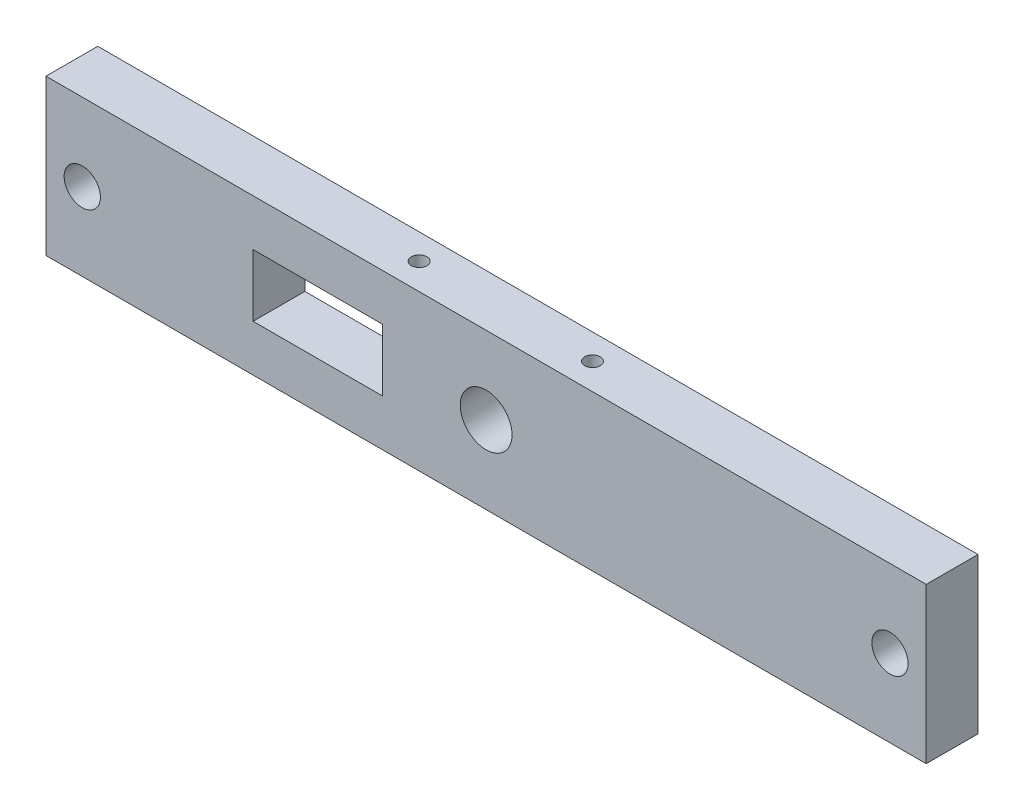
ISO-10303-21;
HEADER;
FILE_DESCRIPTION(('STEP AP214'),'2;1');
FILE_NAME('part.step','',(''),(''),'','','');
FILE_SCHEMA(('AUTOMOTIVE_DESIGN { 1 0 10303 214 1 1 1 1 }'));
ENDSEC;
DATA;
#1=APPLICATION_CONTEXT('core data for automotive mechanical design processes');
#2=APPLICATION_PROTOCOL_DEFINITION('international standard','automotive_design',2000,#1);
#3=PRODUCT_CONTEXT('',#1,'mechanical');
#4=PRODUCT('Part','Part','',(#3));
#5=PRODUCT_RELATED_PRODUCT_CATEGORY('part','',(#4));
#6=PRODUCT_DEFINITION_FORMATION('','',#4);
#7=PRODUCT_DEFINITION_CONTEXT('part definition',#1,'design');
#8=PRODUCT_DEFINITION('design','',#6,#7);
#9=PRODUCT_DEFINITION_SHAPE('','',#8);
#10=(LENGTH_UNIT() NAMED_UNIT(*) SI_UNIT(.MILLI.,.METRE.));
#11=(NAMED_UNIT(*) PLANE_ANGLE_UNIT() SI_UNIT($,.RADIAN.));
#12=(NAMED_UNIT(*) SI_UNIT($,.STERADIAN.) SOLID_ANGLE_UNIT());
#13=UNCERTAINTY_MEASURE_WITH_UNIT(LENGTH_MEASURE(1.E-05),#10,'distance_accuracy_value','');
#14=(GEOMETRIC_REPRESENTATION_CONTEXT(3) GLOBAL_UNCERTAINTY_ASSIGNED_CONTEXT((#13)) GLOBAL_UNIT_ASSIGNED_CONTEXT((#10,
#11,#12)) REPRESENTATION_CONTEXT('',''));
#15=CARTESIAN_POINT('',(0.,0.,0.));
#16=DIRECTION('',(0.,0.,1.));
#17=DIRECTION('',(1.,0.,0.));
#18=AXIS2_PLACEMENT_3D('',#15,#16,#17);
#19=CARTESIAN_POINT('',(-277.217741935484,26.4516129032258,10.));
#20=DIRECTION('',(0.,1.,0.));
#21=DIRECTION('',(0.,0.,1.));
#22=AXIS2_PLACEMENT_3D('',#19,#20,#21);
#23=PLANE('',#22);
#24=CARTESIAN_POINT('',(-210.232722869532,26.4516129032258,4.91811372302718));
#25=DIRECTION('',(0.,1.,0.));
#26=DIRECTION('',(0.,0.,1.));
#27=AXIS2_PLACEMENT_3D('',#24,#25,#26);
#28=CIRCLE('',#27,1.5);
#29=CARTESIAN_POINT('',(-210.232722869532,26.4516129032258,6.41811372302718));
#30=VERTEX_POINT('',#29);
#31=EDGE_CURVE('E131',#30,#30,#28,.F.);
#32=ORIENTED_EDGE('',*,*,#31,.F.);
#33=EDGE_LOOP('',(#32));
#34=FACE_BOUND('',#33,.T.);
#35=DIRECTION('',(1.,0.,0.));
#36=VECTOR('',#35,1.);
#37=CARTESIAN_POINT('',(-277.217741935484,26.4516129032258,0.));
#38=LINE('',#37,#36);
#39=CARTESIAN_POINT('',(-277.217741935484,26.4516129032258,0.));
#40=VERTEX_POINT('',#39);
#41=CARTESIAN_POINT('',(-107.217741935484,26.4516129032258,0.));
#42=VERTEX_POINT('',#41);
#43=EDGE_CURVE('E172',#40,#42,#38,.T.);
#44=ORIENTED_EDGE('',*,*,#43,.T.);
#45=DIRECTION('',(0.,0.,-1.));
#46=VECTOR('',#45,1.);
#47=CARTESIAN_POINT('',(-107.217741935484,26.4516129032258,10.));
#48=LINE('',#47,#46);
#49=CARTESIAN_POINT('',(-107.217741935484,26.4516129032258,10.));
#50=VERTEX_POINT('',#49);
#51=EDGE_CURVE('E44',#50,#42,#48,.T.);
#52=ORIENTED_EDGE('',*,*,#51,.F.);
#53=DIRECTION('',(1.,0.,0.));
#54=VECTOR('',#53,1.);
#55=CARTESIAN_POINT('',(-277.217741935484,26.4516129032258,10.));
#56=LINE('',#55,#54);
#57=CARTESIAN_POINT('',(-277.217741935484,26.4516129032258,10.));
#58=VERTEX_POINT('',#57);
#59=EDGE_CURVE('E162',#58,#50,#56,.T.);
#60=ORIENTED_EDGE('',*,*,#59,.F.);
#61=DIRECTION('',(0.,0.,-1.));
#62=VECTOR('',#61,1.);
#63=CARTESIAN_POINT('',(-277.217741935484,26.4516129032258,10.));
#64=LINE('',#63,#62);
#65=EDGE_CURVE('E12',#58,#40,#64,.T.);
#66=ORIENTED_EDGE('',*,*,#65,.T.);
#67=EDGE_LOOP('',(#44,#52,#60,#66));
#68=FACE_BOUND('',#67,.T.);
#69=CARTESIAN_POINT('',(-176.768107744617,26.4516129032258,4.91221798755203));
#70=DIRECTION('',(0.,1.,0.));
#71=DIRECTION('',(0.,0.,1.));
#72=AXIS2_PLACEMENT_3D('',#69,#70,#71);
#73=CIRCLE('',#72,1.5);
#74=CARTESIAN_POINT('',(-176.768107744617,26.4516129032258,6.41221798755203));
#75=VERTEX_POINT('',#74);
#76=EDGE_CURVE('E185',#75,#75,#73,.F.);
#77=ORIENTED_EDGE('',*,*,#76,.F.);
#78=EDGE_LOOP('',(#77));
#79=FACE_BOUND('',#78,.T.);
#80=ADVANCED_FACE('F35',(#34,#68,#79),#23,.F.);
#81=CARTESIAN_POINT('',(-277.217741935484,56.4516129032258,10.));
#82=DIRECTION('',(0.,-1.,0.));
#83=DIRECTION('',(0.,0.,-1.));
#84=AXIS2_PLACEMENT_3D('',#81,#82,#83);
#85=PLANE('',#84);
#86=CARTESIAN_POINT('',(-210.232722869532,56.4516129032258,4.91811372302718));
#87=DIRECTION('',(0.,-1.,0.));
#88=DIRECTION('',(0.,0.,-1.));
#89=AXIS2_PLACEMENT_3D('',#86,#87,#88);
#90=CIRCLE('',#89,1.5);
#91=CARTESIAN_POINT('',(-210.232722869532,56.4516129032258,3.41811372302718));
#92=VERTEX_POINT('',#91);
#93=EDGE_CURVE('E183',#92,#92,#90,.F.);
#94=ORIENTED_EDGE('',*,*,#93,.F.);
#95=EDGE_LOOP('',(#94));
#96=FACE_BOUND('',#95,.T.);
#97=DIRECTION('',(-1.,0.,0.));
#98=VECTOR('',#97,1.);
#99=CARTESIAN_POINT('',(-277.217741935484,56.4516129032258,0.));
#100=LINE('',#99,#98);
#101=CARTESIAN_POINT('',(-107.217741935484,56.4516129032258,0.));
#102=VERTEX_POINT('',#101);
#103=CARTESIAN_POINT('',(-277.217741935484,56.4516129032258,0.));
#104=VERTEX_POINT('',#103);
#105=EDGE_CURVE('E163',#102,#104,#100,.T.);
#106=ORIENTED_EDGE('',*,*,#105,.T.);
#107=DIRECTION('',(0.,0.,-1.));
#108=VECTOR('',#107,1.);
#109=CARTESIAN_POINT('',(-277.217741935484,56.4516129032258,10.));
#110=LINE('',#109,#108);
#111=CARTESIAN_POINT('',(-277.217741935484,56.4516129032258,10.));
#112=VERTEX_POINT('',#111);
#113=EDGE_CURVE('E169',#112,#104,#110,.T.);
#114=ORIENTED_EDGE('',*,*,#113,.F.);
#115=DIRECTION('',(-1.,0.,0.));
#116=VECTOR('',#115,1.);
#117=CARTESIAN_POINT('',(-277.217741935484,56.4516129032258,10.));
#118=LINE('',#117,#116);
#119=CARTESIAN_POINT('',(-107.217741935484,56.4516129032258,10.));
#120=VERTEX_POINT('',#119);
#121=EDGE_CURVE('E167',#120,#112,#118,.T.);
#122=ORIENTED_EDGE('',*,*,#121,.F.);
#123=DIRECTION('',(0.,0.,-1.));
#124=VECTOR('',#123,1.);
#125=CARTESIAN_POINT('',(-107.217741935484,56.4516129032258,10.));
#126=LINE('',#125,#124);
#127=EDGE_CURVE('E179',#120,#102,#126,.T.);
#128=ORIENTED_EDGE('',*,*,#127,.T.);
#129=EDGE_LOOP('',(#106,#114,#122,#128));
#130=FACE_BOUND('',#129,.T.);
#131=CARTESIAN_POINT('',(-176.768107744617,56.4516129032258,4.91221798755203));
#132=DIRECTION('',(0.,-1.,0.));
#133=DIRECTION('',(0.,0.,-1.));
#134=AXIS2_PLACEMENT_3D('',#131,#132,#133);
#135=CIRCLE('',#134,1.5);
#136=CARTESIAN_POINT('',(-176.768107744617,56.4516129032258,3.41221798755203));
#137=VERTEX_POINT('',#136);
#138=EDGE_CURVE('E39',#137,#137,#135,.F.);
#139=ORIENTED_EDGE('',*,*,#138,.F.);
#140=EDGE_LOOP('',(#139));
#141=FACE_BOUND('',#140,.T.);
#142=ADVANCED_FACE('F198',(#96,#130,#141),#85,.F.);
#143=CARTESIAN_POINT('',(0.,0.,10.));
#144=DIRECTION('',(0.,0.,1.));
#145=DIRECTION('',(1.,0.,0.));
#146=AXIS2_PLACEMENT_3D('',#143,#144,#145);
#147=PLANE('',#146);
#148=CARTESIAN_POINT('',(-114.217741935484,41.4516129032258,10.));
#149=DIRECTION('',(0.,0.,1.));
#150=DIRECTION('',(1.,0.,0.));
#151=AXIS2_PLACEMENT_3D('',#148,#149,#150);
#152=CIRCLE('',#151,3.50000000000001);
#153=CARTESIAN_POINT('',(-110.717741935484,41.4516129032258,10.));
#154=VERTEX_POINT('',#153);
#155=EDGE_CURVE('E141',#154,#154,#152,.T.);
#156=ORIENTED_EDGE('',*,*,#155,.F.);
#157=EDGE_LOOP('',(#156));
#158=FACE_BOUND('',#157,.T.);
#159=CARTESIAN_POINT('',(-192.217741935484,41.4516129032258,10.));
#160=DIRECTION('',(0.,0.,1.));
#161=DIRECTION('',(1.,0.,0.));
#162=AXIS2_PLACEMENT_3D('',#159,#160,#161);
#163=CIRCLE('',#162,5.00000000000002);
#164=CARTESIAN_POINT('',(-187.217741935484,41.4516129032258,10.));
#165=VERTEX_POINT('',#164);
#166=EDGE_CURVE('E153',#165,#165,#163,.T.);
#167=ORIENTED_EDGE('',*,*,#166,.F.);
#168=EDGE_LOOP('',(#167));
#169=FACE_BOUND('',#168,.T.);
#170=DIRECTION('',(0.,-1.,0.));
#171=VECTOR('',#170,1.);
#172=CARTESIAN_POINT('',(-277.217741935484,56.4516129032258,10.));
#173=LINE('',#172,#171);
#174=EDGE_CURVE('E159',#112,#58,#173,.T.);
#175=ORIENTED_EDGE('',*,*,#174,.T.);
#176=ORIENTED_EDGE('',*,*,#59,.T.);
#177=DIRECTION('',(0.,1.,0.));
#178=VECTOR('',#177,1.);
#179=CARTESIAN_POINT('',(-107.217741935484,56.4516129032258,10.));
#180=LINE('',#179,#178);
#181=EDGE_CURVE('E165',#50,#120,#180,.T.);
#182=ORIENTED_EDGE('',*,*,#181,.T.);
#183=ORIENTED_EDGE('',*,*,#121,.T.);
#184=EDGE_LOOP('',(#175,#176,#182,#183));
#185=FACE_BOUND('',#184,.T.);
#186=CARTESIAN_POINT('',(-270.217741935484,41.4516129032258,10.));
#187=DIRECTION('',(0.,0.,1.));
#188=DIRECTION('',(1.,0.,0.));
#189=AXIS2_PLACEMENT_3D('',#186,#187,#188);
#190=CIRCLE('',#189,3.50000000000002);
#191=CARTESIAN_POINT('',(-266.717741935484,41.4516129032258,10.));
#192=VERTEX_POINT('',#191);
#193=EDGE_CURVE('E147',#192,#192,#190,.T.);
#194=ORIENTED_EDGE('',*,*,#193,.F.);
#195=EDGE_LOOP('',(#194));
#196=FACE_BOUND('',#195,.T.);
#197=DIRECTION('',(1.,0.,0.));
#198=VECTOR('',#197,1.);
#199=CARTESIAN_POINT('',(-237.217741935484,35.4516129032258,10.));
#200=LINE('',#199,#198);
#201=CARTESIAN_POINT('',(-237.217741935484,35.4516129032258,10.));
#202=VERTEX_POINT('',#201);
#203=CARTESIAN_POINT('',(-212.217741935484,35.4516129032258,10.));
#204=VERTEX_POINT('',#203);
#205=EDGE_CURVE('E110',#202,#204,#200,.T.);
#206=ORIENTED_EDGE('',*,*,#205,.F.);
#207=DIRECTION('',(0.,-1.,0.));
#208=VECTOR('',#207,1.);
#209=CARTESIAN_POINT('',(-237.217741935484,47.4516129032258,10.));
#210=LINE('',#209,#208);
#211=CARTESIAN_POINT('',(-237.217741935484,47.4516129032258,10.));
#212=VERTEX_POINT('',#211);
#213=EDGE_CURVE('E102',#212,#202,#210,.T.);
#214=ORIENTED_EDGE('',*,*,#213,.F.);
#215=DIRECTION('',(-1.,0.,0.));
#216=VECTOR('',#215,1.);
#217=CARTESIAN_POINT('',(-237.217741935484,47.4516129032258,10.));
#218=LINE('',#217,#216);
#219=CARTESIAN_POINT('',(-212.217741935484,47.4516129032258,10.));
#220=VERTEX_POINT('',#219);
#221=EDGE_CURVE('E125',#220,#212,#218,.T.);
#222=ORIENTED_EDGE('',*,*,#221,.F.);
#223=DIRECTION('',(0.,1.,0.));
#224=VECTOR('',#223,1.);
#225=CARTESIAN_POINT('',(-212.217741935484,47.4516129032258,10.));
#226=LINE('',#225,#224);
#227=EDGE_CURVE('E123',#204,#220,#226,.T.);
#228=ORIENTED_EDGE('',*,*,#227,.F.);
#229=EDGE_LOOP('',(#206,#214,#222,#228));
#230=FACE_BOUND('',#229,.T.);
#231=ADVANCED_FACE('F122',(#158,#169,#185,#196,#230),#147,.T.);
#232=CARTESIAN_POINT('',(0.,0.,0.));
#233=DIRECTION('',(0.,0.,1.));
#234=DIRECTION('',(1.,0.,0.));
#235=AXIS2_PLACEMENT_3D('',#232,#233,#234);
#236=PLANE('',#235);
#237=CARTESIAN_POINT('',(-114.217741935484,41.4516129032258,0.));
#238=DIRECTION('',(0.,0.,1.));
#239=DIRECTION('',(1.,0.,0.));
#240=AXIS2_PLACEMENT_3D('',#237,#238,#239);
#241=CIRCLE('',#240,3.50000000000001);
#242=CARTESIAN_POINT('',(-110.717741935484,41.4516129032258,0.));
#243=VERTEX_POINT('',#242);
#244=EDGE_CURVE('E118',#243,#243,#241,.T.);
#245=ORIENTED_EDGE('',*,*,#244,.T.);
#246=EDGE_LOOP('',(#245));
#247=FACE_BOUND('',#246,.T.);
#248=CARTESIAN_POINT('',(-192.217741935484,41.4516129032258,0.));
#249=DIRECTION('',(0.,0.,1.));
#250=DIRECTION('',(1.,0.,0.));
#251=AXIS2_PLACEMENT_3D('',#248,#249,#250);
#252=CIRCLE('',#251,5.00000000000002);
#253=CARTESIAN_POINT('',(-187.217741935484,41.4516129032258,0.));
#254=VERTEX_POINT('',#253);
#255=EDGE_CURVE('E150',#254,#254,#252,.T.);
#256=ORIENTED_EDGE('',*,*,#255,.T.);
#257=EDGE_LOOP('',(#256));
#258=FACE_BOUND('',#257,.T.);
#259=DIRECTION('',(0.,-1.,0.));
#260=VECTOR('',#259,1.);
#261=CARTESIAN_POINT('',(-277.217741935484,56.4516129032258,0.));
#262=LINE('',#261,#260);
#263=EDGE_CURVE('E156',#104,#40,#262,.T.);
#264=ORIENTED_EDGE('',*,*,#263,.F.);
#265=ORIENTED_EDGE('',*,*,#105,.F.);
#266=DIRECTION('',(0.,1.,0.));
#267=VECTOR('',#266,1.);
#268=CARTESIAN_POINT('',(-107.217741935484,56.4516129032258,0.));
#269=LINE('',#268,#267);
#270=EDGE_CURVE('E174',#42,#102,#269,.T.);
#271=ORIENTED_EDGE('',*,*,#270,.F.);
#272=ORIENTED_EDGE('',*,*,#43,.F.);
#273=EDGE_LOOP('',(#264,#265,#271,#272));
#274=FACE_BOUND('',#273,.T.);
#275=CARTESIAN_POINT('',(-270.217741935484,41.4516129032258,0.));
#276=DIRECTION('',(0.,0.,1.));
#277=DIRECTION('',(1.,0.,0.));
#278=AXIS2_PLACEMENT_3D('',#275,#276,#277);
#279=CIRCLE('',#278,3.50000000000002);
#280=CARTESIAN_POINT('',(-266.717741935484,41.4516129032258,0.));
#281=VERTEX_POINT('',#280);
#282=EDGE_CURVE('E144',#281,#281,#279,.T.);
#283=ORIENTED_EDGE('',*,*,#282,.T.);
#284=EDGE_LOOP('',(#283));
#285=FACE_BOUND('',#284,.T.);
#286=DIRECTION('',(0.,-1.,0.));
#287=VECTOR('',#286,1.);
#288=CARTESIAN_POINT('',(-237.217741935484,47.4516129032258,0.));
#289=LINE('',#288,#287);
#290=CARTESIAN_POINT('',(-237.217741935484,47.4516129032258,0.));
#291=VERTEX_POINT('',#290);
#292=CARTESIAN_POINT('',(-237.217741935484,35.4516129032258,0.));
#293=VERTEX_POINT('',#292);
#294=EDGE_CURVE('E60',#291,#293,#289,.T.);
#295=ORIENTED_EDGE('',*,*,#294,.T.);
#296=DIRECTION('',(1.,0.,0.));
#297=VECTOR('',#296,1.);
#298=CARTESIAN_POINT('',(-237.217741935484,35.4516129032258,0.));
#299=LINE('',#298,#297);
#300=CARTESIAN_POINT('',(-212.217741935484,35.4516129032258,0.));
#301=VERTEX_POINT('',#300);
#302=EDGE_CURVE('E117',#293,#301,#299,.T.);
#303=ORIENTED_EDGE('',*,*,#302,.T.);
#304=DIRECTION('',(0.,1.,0.));
#305=VECTOR('',#304,1.);
#306=CARTESIAN_POINT('',(-212.217741935484,47.4516129032258,0.));
#307=LINE('',#306,#305);
#308=CARTESIAN_POINT('',(-212.217741935484,47.4516129032258,0.));
#309=VERTEX_POINT('',#308);
#310=EDGE_CURVE('E133',#301,#309,#307,.T.);
#311=ORIENTED_EDGE('',*,*,#310,.T.);
#312=DIRECTION('',(-1.,0.,0.));
#313=VECTOR('',#312,1.);
#314=CARTESIAN_POINT('',(-237.217741935484,47.4516129032258,0.));
#315=LINE('',#314,#313);
#316=EDGE_CURVE('E111',#309,#291,#315,.T.);
#317=ORIENTED_EDGE('',*,*,#316,.T.);
#318=EDGE_LOOP('',(#295,#303,#311,#317));
#319=FACE_BOUND('',#318,.T.);
#320=ADVANCED_FACE('F206',(#247,#258,#274,#285,#319),#236,.F.);
#321=CARTESIAN_POINT('',(-277.217741935484,56.4516129032258,10.));
#322=DIRECTION('',(1.,0.,0.));
#323=DIRECTION('',(0.,0.,-1.));
#324=AXIS2_PLACEMENT_3D('',#321,#322,#323);
#325=PLANE('',#324);
#326=ORIENTED_EDGE('',*,*,#263,.T.);
#327=ORIENTED_EDGE('',*,*,#65,.F.);
#328=ORIENTED_EDGE('',*,*,#174,.F.);
#329=ORIENTED_EDGE('',*,*,#113,.T.);
#330=EDGE_LOOP('',(#326,#327,#328,#329));
#331=FACE_BOUND('',#330,.T.);
#332=ADVANCED_FACE('F37',(#331),#325,.F.);
#333=CARTESIAN_POINT('',(-107.217741935484,56.4516129032258,10.));
#334=DIRECTION('',(-1.,0.,0.));
#335=DIRECTION('',(0.,0.,1.));
#336=AXIS2_PLACEMENT_3D('',#333,#334,#335);
#337=PLANE('',#336);
#338=ORIENTED_EDGE('',*,*,#270,.T.);
#339=ORIENTED_EDGE('',*,*,#127,.F.);
#340=ORIENTED_EDGE('',*,*,#181,.F.);
#341=ORIENTED_EDGE('',*,*,#51,.T.);
#342=EDGE_LOOP('',(#338,#339,#340,#341));
#343=FACE_BOUND('',#342,.T.);
#344=ADVANCED_FACE('F213',(#343),#337,.F.);
#345=CARTESIAN_POINT('',(-192.217741935484,41.4516129032258,10.));
#346=DIRECTION('',(0.,0.,-1.));
#347=DIRECTION('',(-1.,0.,0.));
#348=AXIS2_PLACEMENT_3D('',#345,#346,#347);
#349=CYLINDRICAL_SURFACE('',#348,5.00000000000002);
#350=ORIENTED_EDGE('',*,*,#166,.T.);
#351=EDGE_LOOP('',(#350));
#352=FACE_BOUND('',#351,.T.);
#353=ORIENTED_EDGE('',*,*,#255,.F.);
#354=EDGE_LOOP('',(#353));
#355=FACE_BOUND('',#354,.T.);
#356=ADVANCED_FACE('F215',(#352,#355),#349,.F.);
#357=CARTESIAN_POINT('',(-270.217741935484,41.4516129032258,10.));
#358=DIRECTION('',(0.,0.,-1.));
#359=DIRECTION('',(-1.,0.,0.));
#360=AXIS2_PLACEMENT_3D('',#357,#358,#359);
#361=CYLINDRICAL_SURFACE('',#360,3.50000000000002);
#362=ORIENTED_EDGE('',*,*,#193,.T.);
#363=EDGE_LOOP('',(#362));
#364=FACE_BOUND('',#363,.T.);
#365=ORIENTED_EDGE('',*,*,#282,.F.);
#366=EDGE_LOOP('',(#365));
#367=FACE_BOUND('',#366,.T.);
#368=ADVANCED_FACE('F221',(#364,#367),#361,.F.);
#369=CARTESIAN_POINT('',(-114.217741935484,41.4516129032258,10.));
#370=DIRECTION('',(0.,0.,-1.));
#371=DIRECTION('',(-1.,0.,0.));
#372=AXIS2_PLACEMENT_3D('',#369,#370,#371);
#373=CYLINDRICAL_SURFACE('',#372,3.50000000000001);
#374=ORIENTED_EDGE('',*,*,#155,.T.);
#375=EDGE_LOOP('',(#374));
#376=FACE_BOUND('',#375,.T.);
#377=ORIENTED_EDGE('',*,*,#244,.F.);
#378=EDGE_LOOP('',(#377));
#379=FACE_BOUND('',#378,.T.);
#380=ADVANCED_FACE('F245',(#376,#379),#373,.F.);
#381=CARTESIAN_POINT('',(-237.217741935484,47.4516129032258,10.));
#382=DIRECTION('',(1.,0.,0.));
#383=DIRECTION('',(0.,0.,-1.));
#384=AXIS2_PLACEMENT_3D('',#381,#382,#383);
#385=PLANE('',#384);
#386=ORIENTED_EDGE('',*,*,#294,.F.);
#387=DIRECTION('',(0.,0.,-1.));
#388=VECTOR('',#387,1.);
#389=CARTESIAN_POINT('',(-237.217741935484,47.4516129032258,10.));
#390=LINE('',#389,#388);
#391=EDGE_CURVE('E106',#212,#291,#390,.T.);
#392=ORIENTED_EDGE('',*,*,#391,.F.);
#393=ORIENTED_EDGE('',*,*,#213,.T.);
#394=DIRECTION('',(0.,0.,-1.));
#395=VECTOR('',#394,1.);
#396=CARTESIAN_POINT('',(-237.217741935484,35.4516129032258,10.));
#397=LINE('',#396,#395);
#398=EDGE_CURVE('E105',#202,#293,#397,.T.);
#399=ORIENTED_EDGE('',*,*,#398,.T.);
#400=EDGE_LOOP('',(#386,#392,#393,#399));
#401=FACE_BOUND('',#400,.T.);
#402=ADVANCED_FACE('F104',(#401),#385,.T.);
#403=CARTESIAN_POINT('',(-237.217741935484,35.4516129032258,10.));
#404=DIRECTION('',(0.,1.,0.));
#405=DIRECTION('',(0.,0.,1.));
#406=AXIS2_PLACEMENT_3D('',#403,#404,#405);
#407=PLANE('',#406);
#408=ORIENTED_EDGE('',*,*,#302,.F.);
#409=ORIENTED_EDGE('',*,*,#398,.F.);
#410=ORIENTED_EDGE('',*,*,#205,.T.);
#411=DIRECTION('',(0.,0.,-1.));
#412=VECTOR('',#411,1.);
#413=CARTESIAN_POINT('',(-212.217741935484,35.4516129032258,10.));
#414=LINE('',#413,#412);
#415=EDGE_CURVE('E119',#204,#301,#414,.T.);
#416=ORIENTED_EDGE('',*,*,#415,.T.);
#417=EDGE_LOOP('',(#408,#409,#410,#416));
#418=FACE_BOUND('',#417,.T.);
#419=ADVANCED_FACE('F114',(#418),#407,.T.);
#420=CARTESIAN_POINT('',(-212.217741935484,47.4516129032258,10.));
#421=DIRECTION('',(-1.,0.,0.));
#422=DIRECTION('',(0.,0.,1.));
#423=AXIS2_PLACEMENT_3D('',#420,#421,#422);
#424=PLANE('',#423);
#425=ORIENTED_EDGE('',*,*,#310,.F.);
#426=ORIENTED_EDGE('',*,*,#415,.F.);
#427=ORIENTED_EDGE('',*,*,#227,.T.);
#428=DIRECTION('',(0.,0.,-1.));
#429=VECTOR('',#428,1.);
#430=CARTESIAN_POINT('',(-212.217741935484,47.4516129032258,10.));
#431=LINE('',#430,#429);
#432=EDGE_CURVE('E52',#220,#309,#431,.T.);
#433=ORIENTED_EDGE('',*,*,#432,.T.);
#434=EDGE_LOOP('',(#425,#426,#427,#433));
#435=FACE_BOUND('',#434,.T.);
#436=ADVANCED_FACE('F255',(#435),#424,.T.);
#437=CARTESIAN_POINT('',(-237.217741935484,47.4516129032258,10.));
#438=DIRECTION('',(0.,-1.,0.));
#439=DIRECTION('',(1.,0.,0.));
#440=AXIS2_PLACEMENT_3D('',#437,#438,#439);
#441=PLANE('',#440);
#442=ORIENTED_EDGE('',*,*,#316,.F.);
#443=ORIENTED_EDGE('',*,*,#432,.F.);
#444=ORIENTED_EDGE('',*,*,#221,.T.);
#445=ORIENTED_EDGE('',*,*,#391,.T.);
#446=EDGE_LOOP('',(#442,#443,#444,#445));
#447=FACE_BOUND('',#446,.T.);
#448=ADVANCED_FACE('F252',(#447),#441,.T.);
#449=CARTESIAN_POINT('',(-210.232722869532,32.4629956737243,4.91811372302718));
#450=DIRECTION('',(0.,-1.,0.));
#451=DIRECTION('',(0.,0.,-1.));
#452=AXIS2_PLACEMENT_3D('',#449,#450,#451);
#453=CYLINDRICAL_SURFACE('',#452,1.5);
#454=ORIENTED_EDGE('',*,*,#93,.T.);
#455=EDGE_LOOP('',(#454));
#456=FACE_BOUND('',#455,.T.);
#457=ORIENTED_EDGE('',*,*,#31,.T.);
#458=EDGE_LOOP('',(#457));
#459=FACE_BOUND('',#458,.T.);
#460=ADVANCED_FACE('F254',(#456,#459),#453,.F.);
#461=CARTESIAN_POINT('',(-176.768107744617,30.7358376342065,4.91221798755203));
#462=DIRECTION('',(0.,-1.,0.));
#463=DIRECTION('',(0.,0.,-1.));
#464=AXIS2_PLACEMENT_3D('',#461,#462,#463);
#465=CYLINDRICAL_SURFACE('',#464,1.5);
#466=ORIENTED_EDGE('',*,*,#138,.T.);
#467=EDGE_LOOP('',(#466));
#468=FACE_BOUND('',#467,.T.);
#469=ORIENTED_EDGE('',*,*,#76,.T.);
#470=EDGE_LOOP('',(#469));
#471=FACE_BOUND('',#470,.T.);
#472=ADVANCED_FACE('F196',(#468,#471),#465,.F.);
#473=CLOSED_SHELL('',(#80,#142,#231,#320,#332,#344,#356,#368,#380,#402,#419,#436,#448,#460,#472));
#474=MANIFOLD_SOLID_BREP('B2',#473);
#475=ADVANCED_BREP_SHAPE_REPRESENTATION('',(#18,#474),#14);
#476=SHAPE_DEFINITION_REPRESENTATION(#9,#475);
ENDSEC;
END-ISO-10303-21;
